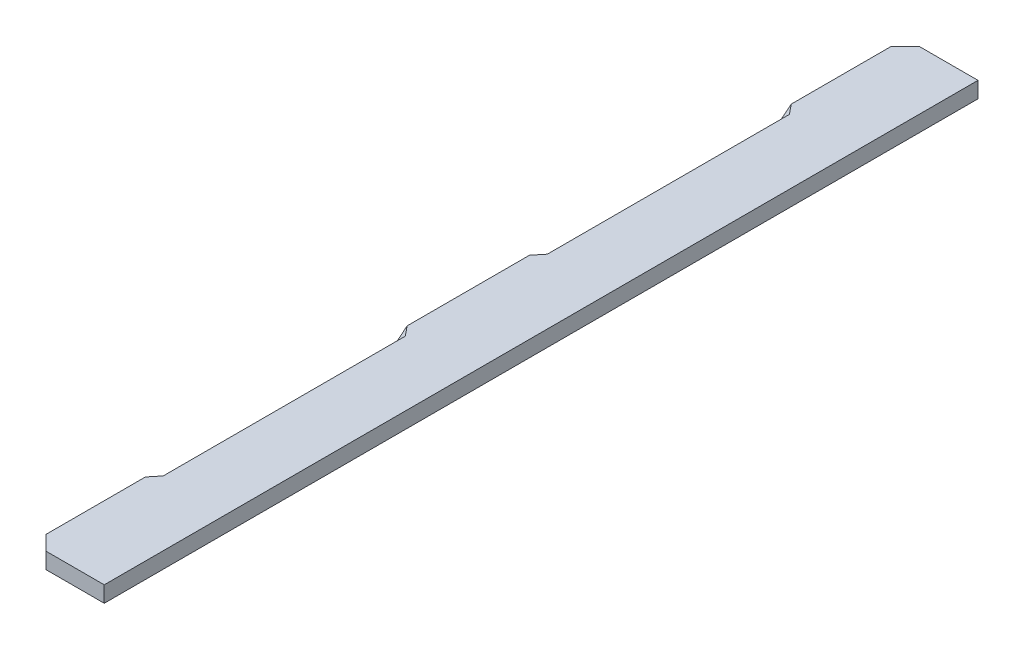
ISO-10303-21;
HEADER;
FILE_DESCRIPTION(('STEP AP214'),'2;1');
FILE_NAME('part.step','',(''),(''),'','','');
FILE_SCHEMA(('AUTOMOTIVE_DESIGN { 1 0 10303 214 1 1 1 1 }'));
ENDSEC;
DATA;
#1=APPLICATION_CONTEXT('core data for automotive mechanical design processes');
#2=APPLICATION_PROTOCOL_DEFINITION('international standard','automotive_design',2000,#1);
#3=PRODUCT_CONTEXT('',#1,'mechanical');
#4=PRODUCT('Part','Part','',(#3));
#5=PRODUCT_RELATED_PRODUCT_CATEGORY('part','',(#4));
#6=PRODUCT_DEFINITION_FORMATION('','',#4);
#7=PRODUCT_DEFINITION_CONTEXT('part definition',#1,'design');
#8=PRODUCT_DEFINITION('design','',#6,#7);
#9=PRODUCT_DEFINITION_SHAPE('','',#8);
#10=(LENGTH_UNIT() NAMED_UNIT(*) SI_UNIT(.MILLI.,.METRE.));
#11=(NAMED_UNIT(*) PLANE_ANGLE_UNIT() SI_UNIT($,.RADIAN.));
#12=(NAMED_UNIT(*) SI_UNIT($,.STERADIAN.) SOLID_ANGLE_UNIT());
#13=UNCERTAINTY_MEASURE_WITH_UNIT(LENGTH_MEASURE(1.E-05),#10,'distance_accuracy_value','');
#14=(GEOMETRIC_REPRESENTATION_CONTEXT(3) GLOBAL_UNCERTAINTY_ASSIGNED_CONTEXT((#13)) GLOBAL_UNIT_ASSIGNED_CONTEXT((#10,
#11,#12)) REPRESENTATION_CONTEXT('',''));
#15=CARTESIAN_POINT('',(0.,0.,0.));
#16=DIRECTION('',(0.,0.,1.));
#17=DIRECTION('',(1.,0.,0.));
#18=AXIS2_PLACEMENT_3D('',#15,#16,#17);
#19=CARTESIAN_POINT('',(-50.0000000000001,22.,-580.));
#20=DIRECTION('',(1.,0.,0.));
#21=DIRECTION('',(0.,0.,-1.));
#22=AXIS2_PLACEMENT_3D('',#19,#20,#21);
#23=PLANE('',#22);
#24=DIRECTION('',(0.,-0.63245553203367,0.774596669241489));
#25=VECTOR('',#24,1.);
#26=CARTESIAN_POINT('',(-50.0000000000001,88.8846922834868,-525.388877434131));
#27=LINE('',#26,#25);
#28=CARTESIAN_POINT('',(-50.0000000000001,22.,-443.472193585325));
#29=VERTEX_POINT('',#28);
#30=CARTESIAN_POINT('',(-49.9999999999988,10.9999999999874,-430.));
#31=VERTEX_POINT('',#30);
#32=EDGE_CURVE('E216',#29,#31,#27,.T.);
#33=ORIENTED_EDGE('',*,*,#32,.F.);
#34=DIRECTION('',(0.,0.,1.));
#35=VECTOR('',#34,1.);
#36=CARTESIAN_POINT('',(-50.0000000000001,22.,-580.));
#37=LINE('',#36,#35);
#38=CARTESIAN_POINT('',(-50.0000000000001,22.,-580.));
#39=VERTEX_POINT('',#38);
#40=EDGE_CURVE('E180',#39,#29,#37,.T.);
#41=ORIENTED_EDGE('',*,*,#40,.F.);
#42=DIRECTION('',(0.,-1.,0.));
#43=VECTOR('',#42,1.);
#44=CARTESIAN_POINT('',(-50.0000000000001,22.,-580.));
#45=LINE('',#44,#43);
#46=CARTESIAN_POINT('',(-50.0000000000001,0.,-580.));
#47=VERTEX_POINT('',#46);
#48=EDGE_CURVE('E195',#39,#47,#45,.T.);
#49=ORIENTED_EDGE('',*,*,#48,.T.);
#50=DIRECTION('',(0.,0.,1.));
#51=VECTOR('',#50,1.);
#52=CARTESIAN_POINT('',(-50.0000000000001,0.,-580.));
#53=LINE('',#52,#51);
#54=CARTESIAN_POINT('',(-49.9999999999999,0.,580.));
#55=VERTEX_POINT('',#54);
#56=EDGE_CURVE('E188',#47,#55,#53,.T.);
#57=ORIENTED_EDGE('',*,*,#56,.T.);
#58=DIRECTION('',(0.,-1.,0.));
#59=VECTOR('',#58,1.);
#60=CARTESIAN_POINT('',(-49.9999999999999,22.,580.));
#61=LINE('',#60,#59);
#62=CARTESIAN_POINT('',(-49.9999999999999,22.,580.));
#63=VERTEX_POINT('',#62);
#64=EDGE_CURVE('E192',#63,#55,#61,.T.);
#65=ORIENTED_EDGE('',*,*,#64,.F.);
#66=CARTESIAN_POINT('',(-50.,22.,443.472193585325));
#67=VERTEX_POINT('',#66);
#68=EDGE_CURVE('E179',#67,#63,#37,.T.);
#69=ORIENTED_EDGE('',*,*,#68,.F.);
#70=DIRECTION('',(0.,-0.63245553203367,-0.774596669241488));
#71=VECTOR('',#70,1.);
#72=CARTESIAN_POINT('',(-50.,15.3999999999917,435.38887743413));
#73=LINE('',#72,#71);
#74=CARTESIAN_POINT('',(-49.9999999999988,10.9999999999874,430.));
#75=VERTEX_POINT('',#74);
#76=EDGE_CURVE('E209',#67,#75,#73,.T.);
#77=ORIENTED_EDGE('',*,*,#76,.T.);
#78=DIRECTION('',(0.,0.,-1.));
#79=VECTOR('',#78,1.);
#80=CARTESIAN_POINT('',(-49.9999999999988,10.9999999999874,430.));
#81=LINE('',#80,#79);
#82=CARTESIAN_POINT('',(-49.9999999999999,10.9999999999874,97.5));
#83=VERTEX_POINT('',#82);
#84=EDGE_CURVE('E102',#75,#83,#81,.T.);
#85=ORIENTED_EDGE('',*,*,#84,.T.);
#86=DIRECTION('',(0.,0.632455532033674,-0.774596669241485));
#87=VECTOR('',#86,1.);
#88=CARTESIAN_POINT('',(-50.,15.3999999999926,92.1111225658706));
#89=LINE('',#88,#87);
#90=CARTESIAN_POINT('',(-50.,22.,84.027806414677));
#91=VERTEX_POINT('',#90);
#92=EDGE_CURVE('E200',#91,#83,#89,.F.);
#93=ORIENTED_EDGE('',*,*,#92,.F.);
#94=CARTESIAN_POINT('',(-50.,22.,-84.0278064146771));
#95=VERTEX_POINT('',#94);
#96=EDGE_CURVE('E84',#95,#91,#37,.T.);
#97=ORIENTED_EDGE('',*,*,#96,.F.);
#98=DIRECTION('',(0.,0.632455532033674,0.774596669241485));
#99=VECTOR('',#98,1.);
#100=CARTESIAN_POINT('',(-50.,-220.975760178584,-381.611122565872));
#101=LINE('',#100,#99);
#102=CARTESIAN_POINT('',(-49.9999999999999,10.9999999999874,-97.5));
#103=VERTEX_POINT('',#102);
#104=EDGE_CURVE('E51',#95,#103,#101,.F.);
#105=ORIENTED_EDGE('',*,*,#104,.T.);
#106=DIRECTION('',(0.,0.,1.));
#107=VECTOR('',#106,1.);
#108=CARTESIAN_POINT('',(-49.9999999999988,10.9999999999874,-430.));
#109=LINE('',#108,#107);
#110=EDGE_CURVE('E222',#31,#103,#109,.T.);
#111=ORIENTED_EDGE('',*,*,#110,.F.);
#112=EDGE_LOOP('',(#33,#41,#49,#57,#65,#69,#77,#85,#93,#97,#105,#111));
#113=FACE_BOUND('',#112,.T.);
#114=ADVANCED_FACE('F32',(#113),#23,.F.);
#115=CARTESIAN_POINT('',(50.0000000000001,22.,600.));
#116=DIRECTION('',(0.,1.,0.));
#117=DIRECTION('',(0.,0.,1.));
#118=AXIS2_PLACEMENT_3D('',#115,#116,#117);
#119=PLANE('',#118);
#120=ORIENTED_EDGE('',*,*,#40,.T.);
#121=DIRECTION('',(-0.632455532033674,0.,-0.774596669241485));
#122=VECTOR('',#121,1.);
#123=CARTESIAN_POINT('',(-38.9999999999861,22.,-430.));
#124=LINE('',#123,#122);
#125=CARTESIAN_POINT('',(-38.9999999999861,22.,-430.));
#126=VERTEX_POINT('',#125);
#127=EDGE_CURVE('E36',#126,#29,#124,.T.);
#128=ORIENTED_EDGE('',*,*,#127,.F.);
#129=DIRECTION('',(0.,0.,1.));
#130=VECTOR('',#129,1.);
#131=CARTESIAN_POINT('',(-38.9999999999861,22.,-430.));
#132=LINE('',#131,#130);
#133=CARTESIAN_POINT('',(-38.9999999999873,22.,-97.5));
#134=VERTEX_POINT('',#133);
#135=EDGE_CURVE('E77',#126,#134,#132,.T.);
#136=ORIENTED_EDGE('',*,*,#135,.T.);
#137=DIRECTION('',(0.632455532033678,0.,-0.774596669241482));
#138=VECTOR('',#137,1.);
#139=CARTESIAN_POINT('',(-38.999999999987,22.,-97.5000000000003));
#140=LINE('',#139,#138);
#141=EDGE_CURVE('E212',#134,#95,#140,.F.);
#142=ORIENTED_EDGE('',*,*,#141,.T.);
#143=ORIENTED_EDGE('',*,*,#96,.T.);
#144=DIRECTION('',(0.632455532033678,0.,0.774596669241482));
#145=VECTOR('',#144,1.);
#146=CARTESIAN_POINT('',(242.773719149718,22.,442.600917421533));
#147=LINE('',#146,#145);
#148=CARTESIAN_POINT('',(-38.9999999999873,22.,97.5));
#149=VERTEX_POINT('',#148);
#150=EDGE_CURVE('E203',#149,#91,#147,.F.);
#151=ORIENTED_EDGE('',*,*,#150,.F.);
#152=DIRECTION('',(0.,0.,-1.));
#153=VECTOR('',#152,1.);
#154=CARTESIAN_POINT('',(-38.9999999999861,22.,430.));
#155=LINE('',#154,#153);
#156=CARTESIAN_POINT('',(-38.9999999999861,22.,430.));
#157=VERTEX_POINT('',#156);
#158=EDGE_CURVE('E175',#157,#149,#155,.T.);
#159=ORIENTED_EDGE('',*,*,#158,.F.);
#160=DIRECTION('',(-0.632455532033674,0.,0.774596669241485));
#161=VECTOR('',#160,1.);
#162=CARTESIAN_POINT('',(-86.6826512546199,22.,488.399082578467));
#163=LINE('',#162,#161);
#164=EDGE_CURVE('E206',#157,#67,#163,.T.);
#165=ORIENTED_EDGE('',*,*,#164,.T.);
#166=ORIENTED_EDGE('',*,*,#68,.T.);
#167=DIRECTION('',(0.707106781186547,0.,0.707106781186548));
#168=VECTOR('',#167,1.);
#169=CARTESIAN_POINT('',(-49.9999999999999,22.,580.));
#170=LINE('',#169,#168);
#171=CARTESIAN_POINT('',(-29.9999999999999,22.,600.));
#172=VERTEX_POINT('',#171);
#173=EDGE_CURVE('E152',#63,#172,#170,.T.);
#174=ORIENTED_EDGE('',*,*,#173,.T.);
#175=DIRECTION('',(1.,0.,0.));
#176=VECTOR('',#175,1.);
#177=CARTESIAN_POINT('',(-29.9999999999999,22.,600.));
#178=LINE('',#177,#176);
#179=CARTESIAN_POINT('',(50.0000000000001,22.,600.));
#180=VERTEX_POINT('',#179);
#181=EDGE_CURVE('E155',#172,#180,#178,.T.);
#182=ORIENTED_EDGE('',*,*,#181,.T.);
#183=DIRECTION('',(0.,0.,-1.));
#184=VECTOR('',#183,1.);
#185=CARTESIAN_POINT('',(49.9999999999999,22.,-600.));
#186=LINE('',#185,#184);
#187=CARTESIAN_POINT('',(49.9999999999999,22.,-600.));
#188=VERTEX_POINT('',#187);
#189=EDGE_CURVE('E159',#180,#188,#186,.T.);
#190=ORIENTED_EDGE('',*,*,#189,.T.);
#191=DIRECTION('',(-1.,0.,0.));
#192=VECTOR('',#191,1.);
#193=CARTESIAN_POINT('',(-30.0000000000001,22.,-600.));
#194=LINE('',#193,#192);
#195=CARTESIAN_POINT('',(-30.0000000000001,22.,-600.));
#196=VERTEX_POINT('',#195);
#197=EDGE_CURVE('E139',#188,#196,#194,.T.);
#198=ORIENTED_EDGE('',*,*,#197,.T.);
#199=DIRECTION('',(-0.707106781186547,0.,0.707106781186548));
#200=VECTOR('',#199,1.);
#201=CARTESIAN_POINT('',(-50.0000000000001,22.,-580.));
#202=LINE('',#201,#200);
#203=EDGE_CURVE('E170',#196,#39,#202,.T.);
#204=ORIENTED_EDGE('',*,*,#203,.T.);
#205=EDGE_LOOP('',(#120,#128,#136,#142,#143,#151,#159,#165,#166,#174,#182,#190,#198,#204));
#206=FACE_BOUND('',#205,.T.);
#207=ADVANCED_FACE('F157',(#206),#119,.T.);
#208=CARTESIAN_POINT('',(49.9999999999999,22.,-600.));
#209=DIRECTION('',(-1.,0.,0.));
#210=DIRECTION('',(0.,0.,1.));
#211=AXIS2_PLACEMENT_3D('',#208,#209,#210);
#212=PLANE('',#211);
#213=DIRECTION('',(0.,0.,-1.));
#214=VECTOR('',#213,1.);
#215=CARTESIAN_POINT('',(49.9999999999999,0.,-600.));
#216=LINE('',#215,#214);
#217=CARTESIAN_POINT('',(50.0000000000001,0.,600.));
#218=VERTEX_POINT('',#217);
#219=CARTESIAN_POINT('',(49.9999999999999,0.,-600.));
#220=VERTEX_POINT('',#219);
#221=EDGE_CURVE('E183',#218,#220,#216,.T.);
#222=ORIENTED_EDGE('',*,*,#221,.T.);
#223=DIRECTION('',(0.,-1.,0.));
#224=VECTOR('',#223,1.);
#225=CARTESIAN_POINT('',(49.9999999999999,22.,-600.));
#226=LINE('',#225,#224);
#227=EDGE_CURVE('E11',#188,#220,#226,.T.);
#228=ORIENTED_EDGE('',*,*,#227,.F.);
#229=ORIENTED_EDGE('',*,*,#189,.F.);
#230=DIRECTION('',(0.,-1.,0.));
#231=VECTOR('',#230,1.);
#232=CARTESIAN_POINT('',(50.0000000000001,22.,600.));
#233=LINE('',#232,#231);
#234=EDGE_CURVE('E161',#180,#218,#233,.T.);
#235=ORIENTED_EDGE('',*,*,#234,.T.);
#236=EDGE_LOOP('',(#222,#228,#229,#235));
#237=FACE_BOUND('',#236,.T.);
#238=ADVANCED_FACE('F168',(#237),#212,.F.);
#239=CARTESIAN_POINT('',(-30.0000000000001,22.,-600.));
#240=DIRECTION('',(0.,0.,1.));
#241=DIRECTION('',(1.,0.,0.));
#242=AXIS2_PLACEMENT_3D('',#239,#240,#241);
#243=PLANE('',#242);
#244=DIRECTION('',(-1.,0.,0.));
#245=VECTOR('',#244,1.);
#246=CARTESIAN_POINT('',(-30.0000000000001,0.,-600.));
#247=LINE('',#246,#245);
#248=CARTESIAN_POINT('',(-30.0000000000001,0.,-600.));
#249=VERTEX_POINT('',#248);
#250=EDGE_CURVE('E111',#220,#249,#247,.T.);
#251=ORIENTED_EDGE('',*,*,#250,.T.);
#252=DIRECTION('',(0.,-1.,0.));
#253=VECTOR('',#252,1.);
#254=CARTESIAN_POINT('',(-30.0000000000001,22.,-600.));
#255=LINE('',#254,#253);
#256=EDGE_CURVE('E42',#196,#249,#255,.T.);
#257=ORIENTED_EDGE('',*,*,#256,.F.);
#258=ORIENTED_EDGE('',*,*,#197,.F.);
#259=ORIENTED_EDGE('',*,*,#227,.T.);
#260=EDGE_LOOP('',(#251,#257,#258,#259));
#261=FACE_BOUND('',#260,.T.);
#262=ADVANCED_FACE('F244',(#261),#243,.F.);
#263=CARTESIAN_POINT('',(-50.0000000000001,22.,-580.));
#264=DIRECTION('',(0.707106781186548,0.,0.707106781186547));
#265=DIRECTION('',(0.707106781186547,0.,-0.707106781186548));
#266=AXIS2_PLACEMENT_3D('',#263,#264,#265);
#267=PLANE('',#266);
#268=DIRECTION('',(-0.707106781186547,0.,0.707106781186548));
#269=VECTOR('',#268,1.);
#270=CARTESIAN_POINT('',(-50.0000000000001,0.,-580.));
#271=LINE('',#270,#269);
#272=EDGE_CURVE('E186',#249,#47,#271,.T.);
#273=ORIENTED_EDGE('',*,*,#272,.T.);
#274=ORIENTED_EDGE('',*,*,#48,.F.);
#275=ORIENTED_EDGE('',*,*,#203,.F.);
#276=ORIENTED_EDGE('',*,*,#256,.T.);
#277=EDGE_LOOP('',(#273,#274,#275,#276));
#278=FACE_BOUND('',#277,.T.);
#279=ADVANCED_FACE('F241',(#278),#267,.F.);
#280=CARTESIAN_POINT('',(-49.9999999999999,22.,580.));
#281=DIRECTION('',(0.707106781186548,0.,-0.707106781186547));
#282=DIRECTION('',(-0.707106781186547,0.,-0.707106781186548));
#283=AXIS2_PLACEMENT_3D('',#280,#281,#282);
#284=PLANE('',#283);
#285=DIRECTION('',(0.707106781186547,0.,0.707106781186548));
#286=VECTOR('',#285,1.);
#287=CARTESIAN_POINT('',(-49.9999999999999,0.,580.));
#288=LINE('',#287,#286);
#289=CARTESIAN_POINT('',(-29.9999999999999,0.,600.));
#290=VERTEX_POINT('',#289);
#291=EDGE_CURVE('E172',#55,#290,#288,.T.);
#292=ORIENTED_EDGE('',*,*,#291,.T.);
#293=DIRECTION('',(0.,-1.,0.));
#294=VECTOR('',#293,1.);
#295=CARTESIAN_POINT('',(-29.9999999999999,22.,600.));
#296=LINE('',#295,#294);
#297=EDGE_CURVE('E166',#172,#290,#296,.T.);
#298=ORIENTED_EDGE('',*,*,#297,.F.);
#299=ORIENTED_EDGE('',*,*,#173,.F.);
#300=ORIENTED_EDGE('',*,*,#64,.T.);
#301=EDGE_LOOP('',(#292,#298,#299,#300));
#302=FACE_BOUND('',#301,.T.);
#303=ADVANCED_FACE('F237',(#302),#284,.F.);
#304=CARTESIAN_POINT('',(-29.9999999999999,22.,600.));
#305=DIRECTION('',(0.,0.,-1.));
#306=DIRECTION('',(-1.,0.,0.));
#307=AXIS2_PLACEMENT_3D('',#304,#305,#306);
#308=PLANE('',#307);
#309=DIRECTION('',(1.,0.,0.));
#310=VECTOR('',#309,1.);
#311=CARTESIAN_POINT('',(-29.9999999999999,0.,600.));
#312=LINE('',#311,#310);
#313=EDGE_CURVE('E131',#290,#218,#312,.T.);
#314=ORIENTED_EDGE('',*,*,#313,.T.);
#315=ORIENTED_EDGE('',*,*,#234,.F.);
#316=ORIENTED_EDGE('',*,*,#181,.F.);
#317=ORIENTED_EDGE('',*,*,#297,.T.);
#318=EDGE_LOOP('',(#314,#315,#316,#317));
#319=FACE_BOUND('',#318,.T.);
#320=ADVANCED_FACE('F163',(#319),#308,.F.);
#321=CARTESIAN_POINT('',(50.0000000000001,0.,600.));
#322=DIRECTION('',(0.,1.,0.));
#323=DIRECTION('',(0.,0.,1.));
#324=AXIS2_PLACEMENT_3D('',#321,#322,#323);
#325=PLANE('',#324);
#326=ORIENTED_EDGE('',*,*,#221,.F.);
#327=ORIENTED_EDGE('',*,*,#313,.F.);
#328=ORIENTED_EDGE('',*,*,#291,.F.);
#329=ORIENTED_EDGE('',*,*,#56,.F.);
#330=ORIENTED_EDGE('',*,*,#272,.F.);
#331=ORIENTED_EDGE('',*,*,#250,.F.);
#332=EDGE_LOOP('',(#326,#327,#328,#329,#330,#331));
#333=FACE_BOUND('',#332,.T.);
#334=ADVANCED_FACE('F238',(#333),#325,.F.);
#335=CARTESIAN_POINT('',(-38.9999999999861,22.,430.));
#336=DIRECTION('',(-0.707106781186544,0.707106781186551,0.));
#337=DIRECTION('',(-0.707106781186551,-0.707106781186544,0.));
#338=AXIS2_PLACEMENT_3D('',#335,#336,#337);
#339=PLANE('',#338);
#340=DIRECTION('',(0.707106781186551,0.707106781186544,0.));
#341=VECTOR('',#340,1.);
#342=CARTESIAN_POINT('',(-38.9999999999873,22.,97.5));
#343=LINE('',#342,#341);
#344=EDGE_CURVE('E205',#83,#149,#343,.T.);
#345=ORIENTED_EDGE('',*,*,#344,.F.);
#346=ORIENTED_EDGE('',*,*,#84,.F.);
#347=DIRECTION('',(0.707106781186551,0.707106781186544,0.));
#348=VECTOR('',#347,1.);
#349=CARTESIAN_POINT('',(-38.9999999999861,22.,430.));
#350=LINE('',#349,#348);
#351=EDGE_CURVE('E202',#75,#157,#350,.T.);
#352=ORIENTED_EDGE('',*,*,#351,.T.);
#353=ORIENTED_EDGE('',*,*,#158,.T.);
#354=EDGE_LOOP('',(#345,#346,#352,#353));
#355=FACE_BOUND('',#354,.T.);
#356=ADVANCED_FACE('F229',(#355),#339,.T.);
#357=CARTESIAN_POINT('',(-38.9999999999861,22.,430.));
#358=DIRECTION('',(-0.612372435695793,0.612372435695799,-0.499999999999996));
#359=DIRECTION('',(-0.707106781186551,-0.707106781186544,0.));
#360=AXIS2_PLACEMENT_3D('',#357,#358,#359);
#361=PLANE('',#360);
#362=ORIENTED_EDGE('',*,*,#351,.F.);
#363=ORIENTED_EDGE('',*,*,#76,.F.);
#364=ORIENTED_EDGE('',*,*,#164,.F.);
#365=EDGE_LOOP('',(#362,#363,#364));
#366=FACE_BOUND('',#365,.T.);
#367=ADVANCED_FACE('F268',(#366),#361,.T.);
#368=CARTESIAN_POINT('',(-38.9999999999867,22.0000000000006,97.5));
#369=DIRECTION('',(-0.612372435695791,0.612372435695798,0.5));
#370=DIRECTION('',(-0.707106781186551,-0.707106781186544,0.));
#371=AXIS2_PLACEMENT_3D('',#368,#369,#370);
#372=PLANE('',#371);
#373=ORIENTED_EDGE('',*,*,#344,.T.);
#374=ORIENTED_EDGE('',*,*,#150,.T.);
#375=ORIENTED_EDGE('',*,*,#92,.T.);
#376=EDGE_LOOP('',(#373,#374,#375));
#377=FACE_BOUND('',#376,.T.);
#378=ADVANCED_FACE('F231',(#377),#372,.T.);
#379=CARTESIAN_POINT('',(-38.9999999999861,22.,-430.));
#380=DIRECTION('',(0.707106781186544,-0.707106781186551,0.));
#381=DIRECTION('',(0.707106781186551,0.707106781186544,0.));
#382=AXIS2_PLACEMENT_3D('',#379,#380,#381);
#383=PLANE('',#382);
#384=DIRECTION('',(0.707106781186551,0.707106781186544,0.));
#385=VECTOR('',#384,1.);
#386=CARTESIAN_POINT('',(-38.9999999999873,22.,-97.5));
#387=LINE('',#386,#385);
#388=EDGE_CURVE('E215',#103,#134,#387,.T.);
#389=ORIENTED_EDGE('',*,*,#388,.T.);
#390=ORIENTED_EDGE('',*,*,#135,.F.);
#391=DIRECTION('',(0.707106781186551,0.707106781186544,0.));
#392=VECTOR('',#391,1.);
#393=CARTESIAN_POINT('',(-38.9999999999861,22.,-430.));
#394=LINE('',#393,#392);
#395=EDGE_CURVE('E214',#31,#126,#394,.T.);
#396=ORIENTED_EDGE('',*,*,#395,.F.);
#397=ORIENTED_EDGE('',*,*,#110,.T.);
#398=EDGE_LOOP('',(#389,#390,#396,#397));
#399=FACE_BOUND('',#398,.T.);
#400=ADVANCED_FACE('F269',(#399),#383,.F.);
#401=CARTESIAN_POINT('',(-38.9999999999861,22.,-430.));
#402=DIRECTION('',(-0.612372435695793,0.612372435695799,0.499999999999996));
#403=DIRECTION('',(-0.707106781186551,-0.707106781186544,0.));
#404=AXIS2_PLACEMENT_3D('',#401,#402,#403);
#405=PLANE('',#404);
#406=ORIENTED_EDGE('',*,*,#395,.T.);
#407=ORIENTED_EDGE('',*,*,#127,.T.);
#408=ORIENTED_EDGE('',*,*,#32,.T.);
#409=EDGE_LOOP('',(#406,#407,#408));
#410=FACE_BOUND('',#409,.T.);
#411=ADVANCED_FACE('F34',(#410),#405,.T.);
#412=CARTESIAN_POINT('',(-38.9999999999867,22.0000000000006,-97.5));
#413=DIRECTION('',(-0.612372435695791,0.612372435695798,-0.5));
#414=DIRECTION('',(-0.707106781186551,-0.707106781186544,0.));
#415=AXIS2_PLACEMENT_3D('',#412,#413,#414);
#416=PLANE('',#415);
#417=ORIENTED_EDGE('',*,*,#388,.F.);
#418=ORIENTED_EDGE('',*,*,#104,.F.);
#419=ORIENTED_EDGE('',*,*,#141,.F.);
#420=EDGE_LOOP('',(#417,#418,#419));
#421=FACE_BOUND('',#420,.T.);
#422=ADVANCED_FACE('F275',(#421),#416,.T.);
#423=CLOSED_SHELL('',(#114,#207,#238,#262,#279,#303,#320,#334,#356,#367,#378,#400,#411,#422));
#424=MANIFOLD_SOLID_BREP('B2',#423);
#425=ADVANCED_BREP_SHAPE_REPRESENTATION('',(#18,#424),#14);
#426=SHAPE_DEFINITION_REPRESENTATION(#9,#425);
ENDSEC;
END-ISO-10303-21;
